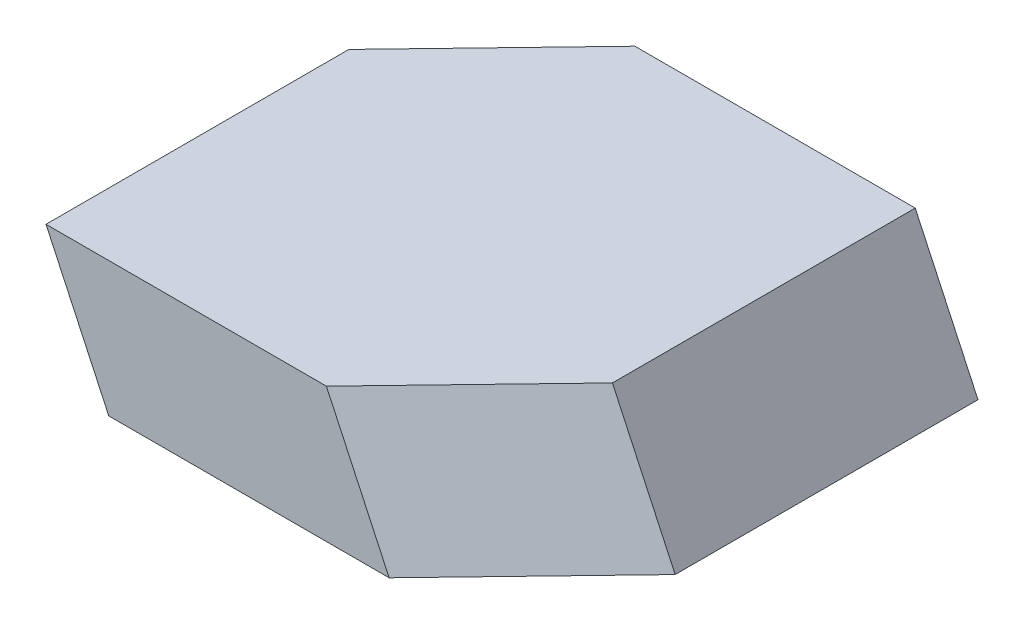
ISO-10303-21;
HEADER;
FILE_DESCRIPTION(('STEP AP214'),'2;1');
FILE_NAME('part.step','',(''),(''),'','','');
FILE_SCHEMA(('AUTOMOTIVE_DESIGN { 1 0 10303 214 1 1 1 1 }'));
ENDSEC;
DATA;
#1=APPLICATION_CONTEXT('core data for automotive mechanical design processes');
#2=APPLICATION_PROTOCOL_DEFINITION('international standard','automotive_design',2000,#1);
#3=PRODUCT_CONTEXT('',#1,'mechanical');
#4=PRODUCT('Part','Part','',(#3));
#5=PRODUCT_RELATED_PRODUCT_CATEGORY('part','',(#4));
#6=PRODUCT_DEFINITION_FORMATION('','',#4);
#7=PRODUCT_DEFINITION_CONTEXT('part definition',#1,'design');
#8=PRODUCT_DEFINITION('design','',#6,#7);
#9=PRODUCT_DEFINITION_SHAPE('','',#8);
#10=(LENGTH_UNIT() NAMED_UNIT(*) SI_UNIT(.MILLI.,.METRE.));
#11=(NAMED_UNIT(*) PLANE_ANGLE_UNIT() SI_UNIT($,.RADIAN.));
#12=(NAMED_UNIT(*) SI_UNIT($,.STERADIAN.) SOLID_ANGLE_UNIT());
#13=UNCERTAINTY_MEASURE_WITH_UNIT(LENGTH_MEASURE(1.E-05),#10,'distance_accuracy_value','');
#14=(GEOMETRIC_REPRESENTATION_CONTEXT(3) GLOBAL_UNCERTAINTY_ASSIGNED_CONTEXT((#13)) GLOBAL_UNIT_ASSIGNED_CONTEXT((#10,
#11,#12)) REPRESENTATION_CONTEXT('',''));
#15=CARTESIAN_POINT('',(0.,0.,0.));
#16=DIRECTION('',(0.,0.,1.));
#17=DIRECTION('',(1.,0.,0.));
#18=AXIS2_PLACEMENT_3D('',#15,#16,#17);
#19=CARTESIAN_POINT('',(38.8086162042799,24.,0.));
#20=DIRECTION('',(0.,1.,0.));
#21=DIRECTION('',(0.,0.,1.));
#22=AXIS2_PLACEMENT_3D('',#19,#20,#21);
#23=PLANE('',#22);
#24=DIRECTION('',(-1.,0.,0.));
#25=VECTOR('',#24,1.);
#26=CARTESIAN_POINT('',(38.8086162042799,24.,0.));
#27=LINE('',#26,#25);
#28=CARTESIAN_POINT('',(38.8086162042799,24.,0.));
#29=VERTEX_POINT('',#28);
#30=CARTESIAN_POINT('',(-11.1913837957201,24.,0.));
#31=VERTEX_POINT('',#30);
#32=EDGE_CURVE('E106',#29,#31,#27,.T.);
#33=ORIENTED_EDGE('',*,*,#32,.T.);
#34=DIRECTION('',(-0.693108716251784,0.,0.720833064901856));
#35=VECTOR('',#34,1.);
#36=CARTESIAN_POINT('',(-11.1913837957201,24.,0.));
#37=LINE('',#36,#35);
#38=CARTESIAN_POINT('',(-36.1913837957201,24.,26.));
#39=VERTEX_POINT('',#38);
#40=EDGE_CURVE('E125',#31,#39,#37,.T.);
#41=ORIENTED_EDGE('',*,*,#40,.T.);
#42=DIRECTION('',(0.,0.,1.));
#43=VECTOR('',#42,1.);
#44=CARTESIAN_POINT('',(-36.1913837957201,24.,26.));
#45=LINE('',#44,#43);
#46=CARTESIAN_POINT('',(-36.1913837957201,24.,80.));
#47=VERTEX_POINT('',#46);
#48=EDGE_CURVE('E184',#39,#47,#45,.T.);
#49=ORIENTED_EDGE('',*,*,#48,.T.);
#50=DIRECTION('',(1.,0.,0.));
#51=VECTOR('',#50,1.);
#52=CARTESIAN_POINT('',(13.8086162042799,24.,80.));
#53=LINE('',#52,#51);
#54=CARTESIAN_POINT('',(13.8086162042799,24.,80.));
#55=VERTEX_POINT('',#54);
#56=EDGE_CURVE('E197',#47,#55,#53,.T.);
#57=ORIENTED_EDGE('',*,*,#56,.T.);
#58=DIRECTION('',(0.693108716251784,0.,-0.720833064901856));
#59=VECTOR('',#58,1.);
#60=CARTESIAN_POINT('',(13.8086162042799,24.,80.));
#61=LINE('',#60,#59);
#62=CARTESIAN_POINT('',(38.8086162042799,24.,54.));
#63=VERTEX_POINT('',#62);
#64=EDGE_CURVE('E108',#55,#63,#61,.T.);
#65=ORIENTED_EDGE('',*,*,#64,.T.);
#66=DIRECTION('',(0.,0.,-1.));
#67=VECTOR('',#66,1.);
#68=CARTESIAN_POINT('',(38.8086162042799,24.,0.));
#69=LINE('',#68,#67);
#70=EDGE_CURVE('E102',#63,#29,#69,.T.);
#71=ORIENTED_EDGE('',*,*,#70,.T.);
#72=EDGE_LOOP('',(#33,#41,#49,#57,#65,#71));
#73=FACE_BOUND('',#72,.T.);
#74=ADVANCED_FACE('F42',(#73),#23,.T.);
#75=CARTESIAN_POINT('',(-76.9230769230769,0.,80.));
#76=DIRECTION('',(0.,1.,0.));
#77=DIRECTION('',(0.,0.,1.));
#78=AXIS2_PLACEMENT_3D('',#75,#76,#77);
#79=PLANE('',#78);
#80=DIRECTION('',(-0.693108716251784,0.,0.720833064901856));
#81=VECTOR('',#80,1.);
#82=CARTESIAN_POINT('',(0.,0.,0.));
#83=LINE('',#82,#81);
#84=CARTESIAN_POINT('',(0.,0.,0.));
#85=VERTEX_POINT('',#84);
#86=CARTESIAN_POINT('',(-25.,0.,26.));
#87=VERTEX_POINT('',#86);
#88=EDGE_CURVE('E132',#85,#87,#83,.T.);
#89=ORIENTED_EDGE('',*,*,#88,.F.);
#90=DIRECTION('',(-1.,0.,0.));
#91=VECTOR('',#90,1.);
#92=CARTESIAN_POINT('',(0.,0.,0.));
#93=LINE('',#92,#91);
#94=CARTESIAN_POINT('',(50.,0.,0.));
#95=VERTEX_POINT('',#94);
#96=EDGE_CURVE('E12',#95,#85,#93,.T.);
#97=ORIENTED_EDGE('',*,*,#96,.F.);
#98=DIRECTION('',(0.,0.,-1.));
#99=VECTOR('',#98,1.);
#100=CARTESIAN_POINT('',(50.,0.,0.));
#101=LINE('',#100,#99);
#102=CARTESIAN_POINT('',(50.,0.,54.));
#103=VERTEX_POINT('',#102);
#104=EDGE_CURVE('E54',#103,#95,#101,.T.);
#105=ORIENTED_EDGE('',*,*,#104,.F.);
#106=DIRECTION('',(0.693108716251784,0.,-0.720833064901856));
#107=VECTOR('',#106,1.);
#108=CARTESIAN_POINT('',(25.,0.,80.));
#109=LINE('',#108,#107);
#110=CARTESIAN_POINT('',(25.,0.,80.));
#111=VERTEX_POINT('',#110);
#112=EDGE_CURVE('E234',#111,#103,#109,.T.);
#113=ORIENTED_EDGE('',*,*,#112,.F.);
#114=DIRECTION('',(1.,0.,0.));
#115=VECTOR('',#114,1.);
#116=CARTESIAN_POINT('',(-25.,0.,80.));
#117=LINE('',#116,#115);
#118=CARTESIAN_POINT('',(-25.,0.,80.));
#119=VERTEX_POINT('',#118);
#120=EDGE_CURVE('E68',#119,#111,#117,.T.);
#121=ORIENTED_EDGE('',*,*,#120,.F.);
#122=DIRECTION('',(0.,0.,1.));
#123=VECTOR('',#122,1.);
#124=CARTESIAN_POINT('',(-25.,0.,26.));
#125=LINE('',#124,#123);
#126=EDGE_CURVE('E62',#87,#119,#125,.T.);
#127=ORIENTED_EDGE('',*,*,#126,.F.);
#128=EDGE_LOOP('',(#89,#97,#105,#113,#121,#127));
#129=FACE_BOUND('',#128,.T.);
#130=ADVANCED_FACE('F44',(#129),#79,.F.);
#131=CARTESIAN_POINT('',(-11.1913837957201,24.,0.));
#132=DIRECTION('',(0.,0.,1.));
#133=DIRECTION('',(1.,0.,0.));
#134=AXIS2_PLACEMENT_3D('',#131,#132,#133);
#135=PLANE('',#134);
#136=DIRECTION('',(-0.422618261740704,0.906307787036648,0.));
#137=VECTOR('',#136,1.);
#138=CARTESIAN_POINT('',(0.,0.,0.));
#139=LINE('',#138,#137);
#140=EDGE_CURVE('E124',#85,#31,#139,.T.);
#141=ORIENTED_EDGE('',*,*,#140,.T.);
#142=ORIENTED_EDGE('',*,*,#32,.F.);
#143=DIRECTION('',(-0.422618261740704,0.906307787036648,0.));
#144=VECTOR('',#143,1.);
#145=CARTESIAN_POINT('',(50.,0.,0.));
#146=LINE('',#145,#144);
#147=EDGE_CURVE('E123',#95,#29,#146,.T.);
#148=ORIENTED_EDGE('',*,*,#147,.F.);
#149=ORIENTED_EDGE('',*,*,#96,.T.);
#150=EDGE_LOOP('',(#141,#142,#148,#149));
#151=FACE_BOUND('',#150,.T.);
#152=ADVANCED_FACE('F122',(#151),#135,.F.);
#153=CARTESIAN_POINT('',(38.8086162042799,24.,0.));
#154=DIRECTION('',(-0.906307787036648,-0.422618261740704,0.));
#155=DIRECTION('',(0.422618261740704,-0.906307787036648,0.));
#156=AXIS2_PLACEMENT_3D('',#153,#154,#155);
#157=PLANE('',#156);
#158=ORIENTED_EDGE('',*,*,#147,.T.);
#159=ORIENTED_EDGE('',*,*,#70,.F.);
#160=DIRECTION('',(-0.422618261740704,0.906307787036648,0.));
#161=VECTOR('',#160,1.);
#162=CARTESIAN_POINT('',(50.,0.,54.));
#163=LINE('',#162,#161);
#164=EDGE_CURVE('E114',#103,#63,#163,.T.);
#165=ORIENTED_EDGE('',*,*,#164,.F.);
#166=ORIENTED_EDGE('',*,*,#104,.T.);
#167=EDGE_LOOP('',(#158,#159,#165,#166));
#168=FACE_BOUND('',#167,.T.);
#169=ADVANCED_FACE('F130',(#168),#157,.F.);
#170=CARTESIAN_POINT('',(-36.1913837957201,24.,26.));
#171=DIRECTION('',(0.68326687037979,0.318612574221699,0.656987375365182));
#172=DIRECTION('',(0.693108716251784,0.,-0.720833064901856));
#173=AXIS2_PLACEMENT_3D('',#170,#171,#172);
#174=PLANE('',#173);
#175=DIRECTION('',(-0.422618261740704,0.906307787036648,0.));
#176=VECTOR('',#175,1.);
#177=CARTESIAN_POINT('',(-25.,0.,26.));
#178=LINE('',#177,#176);
#179=EDGE_CURVE('E135',#87,#39,#178,.T.);
#180=ORIENTED_EDGE('',*,*,#179,.T.);
#181=ORIENTED_EDGE('',*,*,#40,.F.);
#182=ORIENTED_EDGE('',*,*,#140,.F.);
#183=ORIENTED_EDGE('',*,*,#88,.T.);
#184=EDGE_LOOP('',(#180,#181,#182,#183));
#185=FACE_BOUND('',#184,.T.);
#186=ADVANCED_FACE('F155',(#185),#174,.F.);
#187=CARTESIAN_POINT('',(-25.,0.,80.));
#188=DIRECTION('',(0.906307787036648,0.422618261740704,0.));
#189=DIRECTION('',(-0.422618261740704,0.906307787036648,0.));
#190=AXIS2_PLACEMENT_3D('',#187,#188,#189);
#191=PLANE('',#190);
#192=DIRECTION('',(-0.422618261740704,0.906307787036648,0.));
#193=VECTOR('',#192,1.);
#194=CARTESIAN_POINT('',(-25.,0.,80.));
#195=LINE('',#194,#193);
#196=EDGE_CURVE('E227',#119,#47,#195,.T.);
#197=ORIENTED_EDGE('',*,*,#196,.T.);
#198=ORIENTED_EDGE('',*,*,#48,.F.);
#199=ORIENTED_EDGE('',*,*,#179,.F.);
#200=ORIENTED_EDGE('',*,*,#126,.T.);
#201=EDGE_LOOP('',(#197,#198,#199,#200));
#202=FACE_BOUND('',#201,.T.);
#203=ADVANCED_FACE('F165',(#202),#191,.F.);
#204=CARTESIAN_POINT('',(13.8086162042799,24.,80.));
#205=DIRECTION('',(0.,0.,-1.));
#206=DIRECTION('',(-1.,0.,0.));
#207=AXIS2_PLACEMENT_3D('',#204,#205,#206);
#208=PLANE('',#207);
#209=DIRECTION('',(-0.422618261740704,0.906307787036648,0.));
#210=VECTOR('',#209,1.);
#211=CARTESIAN_POINT('',(25.,0.,80.));
#212=LINE('',#211,#210);
#213=EDGE_CURVE('E220',#111,#55,#212,.T.);
#214=ORIENTED_EDGE('',*,*,#213,.T.);
#215=ORIENTED_EDGE('',*,*,#56,.F.);
#216=ORIENTED_EDGE('',*,*,#196,.F.);
#217=ORIENTED_EDGE('',*,*,#120,.T.);
#218=EDGE_LOOP('',(#214,#215,#216,#217));
#219=FACE_BOUND('',#218,.T.);
#220=ADVANCED_FACE('F202',(#219),#208,.F.);
#221=CARTESIAN_POINT('',(38.8086162042799,24.,54.));
#222=DIRECTION('',(-0.683266870379789,-0.318612574221699,-0.656987375365182));
#223=DIRECTION('',(-0.693108716251784,0.,0.720833064901856));
#224=AXIS2_PLACEMENT_3D('',#221,#222,#223);
#225=PLANE('',#224);
#226=ORIENTED_EDGE('',*,*,#164,.T.);
#227=ORIENTED_EDGE('',*,*,#64,.F.);
#228=ORIENTED_EDGE('',*,*,#213,.F.);
#229=ORIENTED_EDGE('',*,*,#112,.T.);
#230=EDGE_LOOP('',(#226,#227,#228,#229));
#231=FACE_BOUND('',#230,.T.);
#232=ADVANCED_FACE('F211',(#231),#225,.F.);
#233=CLOSED_SHELL('',(#74,#130,#152,#169,#186,#203,#220,#232));
#234=MANIFOLD_SOLID_BREP('B2',#233);
#235=ADVANCED_BREP_SHAPE_REPRESENTATION('',(#18,#234),#14);
#236=SHAPE_DEFINITION_REPRESENTATION(#9,#235);
ENDSEC;
END-ISO-10303-21;
